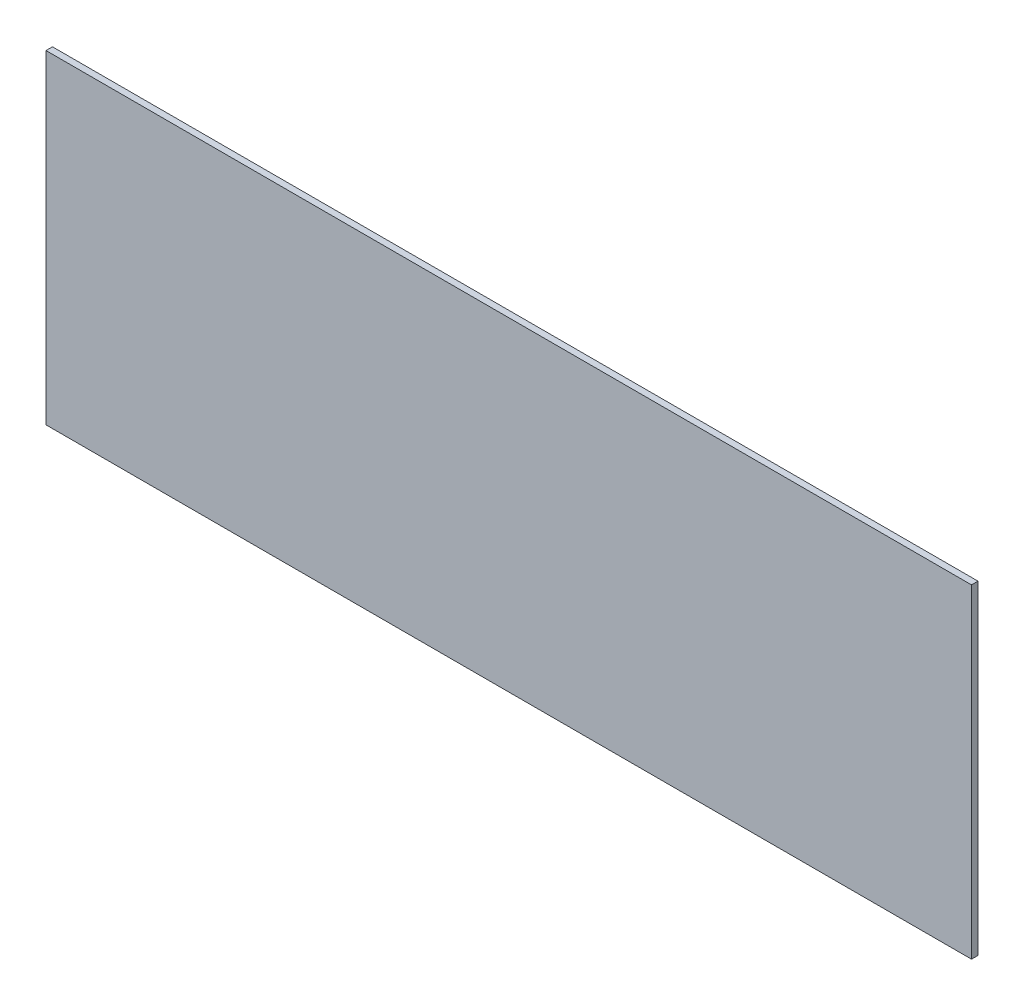
ISO-10303-21;
HEADER;
FILE_DESCRIPTION(('STEP AP214'),'2;1');
FILE_NAME('part.step','',(''),(''),'','','');
FILE_SCHEMA(('AUTOMOTIVE_DESIGN { 1 0 10303 214 1 1 1 1 }'));
ENDSEC;
DATA;
#1=APPLICATION_CONTEXT('core data for automotive mechanical design processes');
#2=APPLICATION_PROTOCOL_DEFINITION('international standard','automotive_design',2000,#1);
#3=PRODUCT_CONTEXT('',#1,'mechanical');
#4=PRODUCT('Part','Part','',(#3));
#5=PRODUCT_RELATED_PRODUCT_CATEGORY('part','',(#4));
#6=PRODUCT_DEFINITION_FORMATION('','',#4);
#7=PRODUCT_DEFINITION_CONTEXT('part definition',#1,'design');
#8=PRODUCT_DEFINITION('design','',#6,#7);
#9=PRODUCT_DEFINITION_SHAPE('','',#8);
#10=(LENGTH_UNIT() NAMED_UNIT(*) SI_UNIT(.MILLI.,.METRE.));
#11=(NAMED_UNIT(*) PLANE_ANGLE_UNIT() SI_UNIT($,.RADIAN.));
#12=(NAMED_UNIT(*) SI_UNIT($,.STERADIAN.) SOLID_ANGLE_UNIT());
#13=UNCERTAINTY_MEASURE_WITH_UNIT(LENGTH_MEASURE(1.E-05),#10,'distance_accuracy_value','');
#14=(GEOMETRIC_REPRESENTATION_CONTEXT(3) GLOBAL_UNCERTAINTY_ASSIGNED_CONTEXT((#13)) GLOBAL_UNIT_ASSIGNED_CONTEXT((#10,
#11,#12)) REPRESENTATION_CONTEXT('',''));
#15=CARTESIAN_POINT('',(0.,0.,0.));
#16=DIRECTION('',(0.,0.,1.));
#17=DIRECTION('',(1.,0.,0.));
#18=AXIS2_PLACEMENT_3D('',#15,#16,#17);
#19=CARTESIAN_POINT('',(142.75,50.,2.));
#20=DIRECTION('',(-1.,0.,0.));
#21=DIRECTION('',(0.,0.,1.));
#22=AXIS2_PLACEMENT_3D('',#19,#20,#21);
#23=PLANE('',#22);
#24=DIRECTION('',(0.,1.,0.));
#25=VECTOR('',#24,1.);
#26=CARTESIAN_POINT('',(142.75,50.,0.));
#27=LINE('',#26,#25);
#28=CARTESIAN_POINT('',(142.75,-50.,0.));
#29=VERTEX_POINT('',#28);
#30=CARTESIAN_POINT('',(142.75,50.,0.));
#31=VERTEX_POINT('',#30);
#32=EDGE_CURVE('E95',#29,#31,#27,.T.);
#33=ORIENTED_EDGE('',*,*,#32,.T.);
#34=DIRECTION('',(0.,0.,-1.));
#35=VECTOR('',#34,1.);
#36=CARTESIAN_POINT('',(142.75,50.,2.));
#37=LINE('',#36,#35);
#38=CARTESIAN_POINT('',(142.75,50.,2.));
#39=VERTEX_POINT('',#38);
#40=EDGE_CURVE('E11',#39,#31,#37,.T.);
#41=ORIENTED_EDGE('',*,*,#40,.F.);
#42=DIRECTION('',(0.,1.,0.));
#43=VECTOR('',#42,1.);
#44=CARTESIAN_POINT('',(142.75,50.,2.));
#45=LINE('',#44,#43);
#46=CARTESIAN_POINT('',(142.75,-50.,2.));
#47=VERTEX_POINT('',#46);
#48=EDGE_CURVE('E83',#47,#39,#45,.T.);
#49=ORIENTED_EDGE('',*,*,#48,.F.);
#50=DIRECTION('',(0.,0.,-1.));
#51=VECTOR('',#50,1.);
#52=CARTESIAN_POINT('',(142.75,-50.,2.));
#53=LINE('',#52,#51);
#54=EDGE_CURVE('E91',#47,#29,#53,.T.);
#55=ORIENTED_EDGE('',*,*,#54,.T.);
#56=EDGE_LOOP('',(#33,#41,#49,#55));
#57=FACE_BOUND('',#56,.T.);
#58=ADVANCED_FACE('F32',(#57),#23,.F.);
#59=CARTESIAN_POINT('',(-142.75,50.,2.));
#60=DIRECTION('',(0.,-1.,0.));
#61=DIRECTION('',(0.,0.,-1.));
#62=AXIS2_PLACEMENT_3D('',#59,#60,#61);
#63=PLANE('',#62);
#64=DIRECTION('',(-1.,0.,0.));
#65=VECTOR('',#64,1.);
#66=CARTESIAN_POINT('',(-142.75,50.,0.));
#67=LINE('',#66,#65);
#68=CARTESIAN_POINT('',(-142.75,50.,0.));
#69=VERTEX_POINT('',#68);
#70=EDGE_CURVE('E87',#31,#69,#67,.T.);
#71=ORIENTED_EDGE('',*,*,#70,.T.);
#72=DIRECTION('',(0.,0.,-1.));
#73=VECTOR('',#72,1.);
#74=CARTESIAN_POINT('',(-142.75,50.,2.));
#75=LINE('',#74,#73);
#76=CARTESIAN_POINT('',(-142.75,50.,2.));
#77=VERTEX_POINT('',#76);
#78=EDGE_CURVE('E40',#77,#69,#75,.T.);
#79=ORIENTED_EDGE('',*,*,#78,.F.);
#80=DIRECTION('',(-1.,0.,0.));
#81=VECTOR('',#80,1.);
#82=CARTESIAN_POINT('',(-142.75,50.,2.));
#83=LINE('',#82,#81);
#84=EDGE_CURVE('E78',#39,#77,#83,.T.);
#85=ORIENTED_EDGE('',*,*,#84,.F.);
#86=ORIENTED_EDGE('',*,*,#40,.T.);
#87=EDGE_LOOP('',(#71,#79,#85,#86));
#88=FACE_BOUND('',#87,.T.);
#89=ADVANCED_FACE('F86',(#88),#63,.F.);
#90=CARTESIAN_POINT('',(-142.75,50.,2.));
#91=DIRECTION('',(1.,0.,0.));
#92=DIRECTION('',(0.,0.,-1.));
#93=AXIS2_PLACEMENT_3D('',#90,#91,#92);
#94=PLANE('',#93);
#95=DIRECTION('',(0.,-1.,0.));
#96=VECTOR('',#95,1.);
#97=CARTESIAN_POINT('',(-142.75,50.,0.));
#98=LINE('',#97,#96);
#99=CARTESIAN_POINT('',(-142.75,-50.,0.));
#100=VERTEX_POINT('',#99);
#101=EDGE_CURVE('E65',#69,#100,#98,.T.);
#102=ORIENTED_EDGE('',*,*,#101,.T.);
#103=DIRECTION('',(0.,0.,-1.));
#104=VECTOR('',#103,1.);
#105=CARTESIAN_POINT('',(-142.75,-50.,2.));
#106=LINE('',#105,#104);
#107=CARTESIAN_POINT('',(-142.75,-50.,2.));
#108=VERTEX_POINT('',#107);
#109=EDGE_CURVE('E88',#108,#100,#106,.T.);
#110=ORIENTED_EDGE('',*,*,#109,.F.);
#111=DIRECTION('',(0.,-1.,0.));
#112=VECTOR('',#111,1.);
#113=CARTESIAN_POINT('',(-142.75,50.,2.));
#114=LINE('',#113,#112);
#115=EDGE_CURVE('E81',#77,#108,#114,.T.);
#116=ORIENTED_EDGE('',*,*,#115,.F.);
#117=ORIENTED_EDGE('',*,*,#78,.T.);
#118=EDGE_LOOP('',(#102,#110,#116,#117));
#119=FACE_BOUND('',#118,.T.);
#120=ADVANCED_FACE('F89',(#119),#94,.F.);
#121=CARTESIAN_POINT('',(-142.75,-50.,2.));
#122=DIRECTION('',(0.,1.,0.));
#123=DIRECTION('',(0.,0.,1.));
#124=AXIS2_PLACEMENT_3D('',#121,#122,#123);
#125=PLANE('',#124);
#126=DIRECTION('',(1.,0.,0.));
#127=VECTOR('',#126,1.);
#128=CARTESIAN_POINT('',(-142.75,-50.,0.));
#129=LINE('',#128,#127);
#130=EDGE_CURVE('E71',#100,#29,#129,.T.);
#131=ORIENTED_EDGE('',*,*,#130,.T.);
#132=ORIENTED_EDGE('',*,*,#54,.F.);
#133=DIRECTION('',(1.,0.,0.));
#134=VECTOR('',#133,1.);
#135=CARTESIAN_POINT('',(-142.75,-50.,2.));
#136=LINE('',#135,#134);
#137=EDGE_CURVE('E48',#108,#47,#136,.T.);
#138=ORIENTED_EDGE('',*,*,#137,.F.);
#139=ORIENTED_EDGE('',*,*,#109,.T.);
#140=EDGE_LOOP('',(#131,#132,#138,#139));
#141=FACE_BOUND('',#140,.T.);
#142=ADVANCED_FACE('F102',(#141),#125,.F.);
#143=CARTESIAN_POINT('',(0.,0.,2.));
#144=DIRECTION('',(0.,0.,1.));
#145=DIRECTION('',(1.,0.,0.));
#146=AXIS2_PLACEMENT_3D('',#143,#144,#145);
#147=PLANE('',#146);
#148=ORIENTED_EDGE('',*,*,#48,.T.);
#149=ORIENTED_EDGE('',*,*,#84,.T.);
#150=ORIENTED_EDGE('',*,*,#115,.T.);
#151=ORIENTED_EDGE('',*,*,#137,.T.);
#152=EDGE_LOOP('',(#148,#149,#150,#151));
#153=FACE_BOUND('',#152,.T.);
#154=ADVANCED_FACE('F79',(#153),#147,.T.);
#155=CARTESIAN_POINT('',(0.,0.,0.));
#156=DIRECTION('',(0.,0.,1.));
#157=DIRECTION('',(1.,0.,0.));
#158=AXIS2_PLACEMENT_3D('',#155,#156,#157);
#159=PLANE('',#158);
#160=ORIENTED_EDGE('',*,*,#32,.F.);
#161=ORIENTED_EDGE('',*,*,#130,.F.);
#162=ORIENTED_EDGE('',*,*,#101,.F.);
#163=ORIENTED_EDGE('',*,*,#70,.F.);
#164=EDGE_LOOP('',(#160,#161,#162,#163));
#165=FACE_BOUND('',#164,.T.);
#166=ADVANCED_FACE('F105',(#165),#159,.F.);
#167=CLOSED_SHELL('',(#58,#89,#120,#142,#154,#166));
#168=MANIFOLD_SOLID_BREP('B2',#167);
#169=ADVANCED_BREP_SHAPE_REPRESENTATION('',(#18,#168),#14);
#170=SHAPE_DEFINITION_REPRESENTATION(#9,#169);
ENDSEC;
END-ISO-10303-21;
